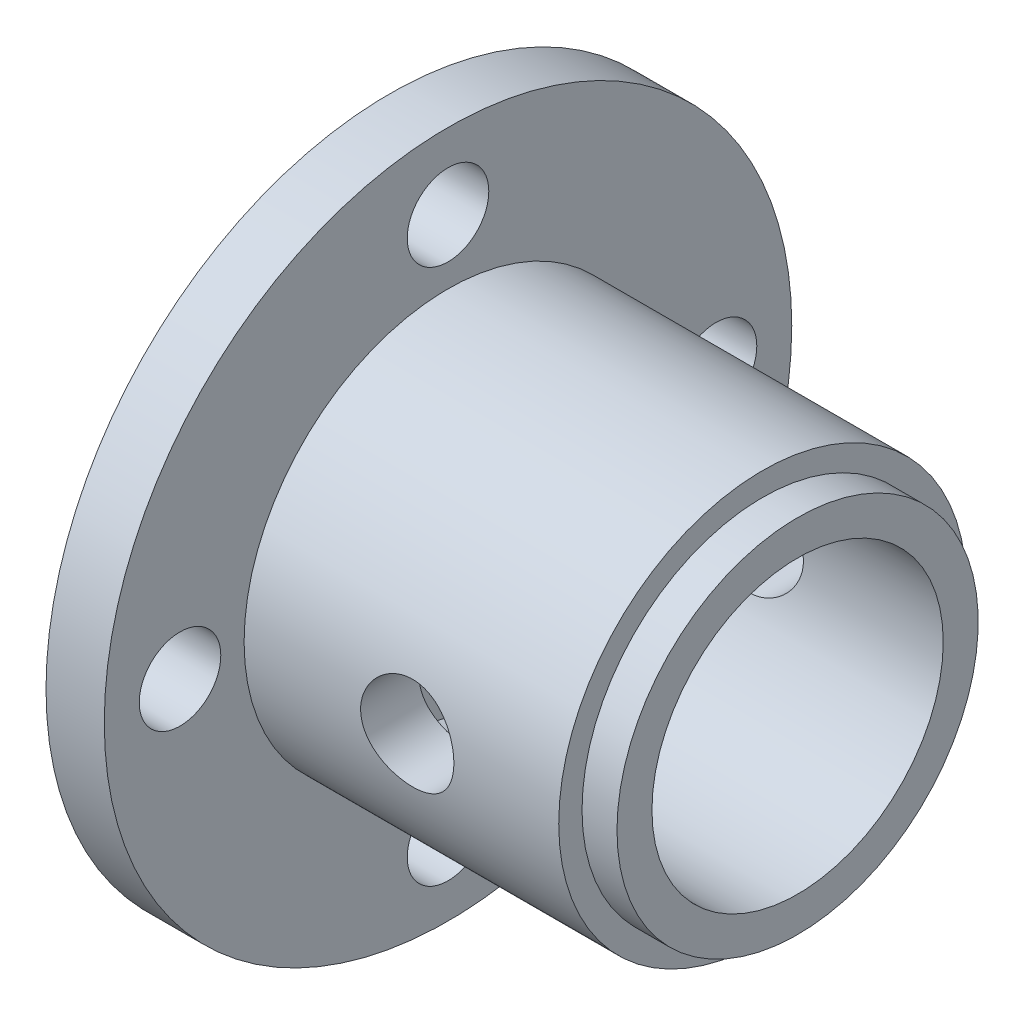
ISO-10303-21;
HEADER;
FILE_DESCRIPTION(('STEP AP214'),'2;1');
FILE_NAME('part.step','',(''),(''),'','','');
FILE_SCHEMA(('AUTOMOTIVE_DESIGN { 1 0 10303 214 1 1 1 1 }'));
ENDSEC;
DATA;
#1=APPLICATION_CONTEXT('core data for automotive mechanical design processes');
#2=APPLICATION_PROTOCOL_DEFINITION('international standard','automotive_design',2000,#1);
#3=PRODUCT_CONTEXT('',#1,'mechanical');
#4=PRODUCT('Part','Part','',(#3));
#5=PRODUCT_RELATED_PRODUCT_CATEGORY('part','',(#4));
#6=PRODUCT_DEFINITION_FORMATION('','',#4);
#7=PRODUCT_DEFINITION_CONTEXT('part definition',#1,'design');
#8=PRODUCT_DEFINITION('design','',#6,#7);
#9=PRODUCT_DEFINITION_SHAPE('','',#8);
#10=(LENGTH_UNIT() NAMED_UNIT(*) SI_UNIT(.MILLI.,.METRE.));
#11=(NAMED_UNIT(*) PLANE_ANGLE_UNIT() SI_UNIT($,.RADIAN.));
#12=(NAMED_UNIT(*) SI_UNIT($,.STERADIAN.) SOLID_ANGLE_UNIT());
#13=UNCERTAINTY_MEASURE_WITH_UNIT(LENGTH_MEASURE(1.E-05),#10,'distance_accuracy_value','');
#14=(GEOMETRIC_REPRESENTATION_CONTEXT(3) GLOBAL_UNCERTAINTY_ASSIGNED_CONTEXT((#13)) GLOBAL_UNIT_ASSIGNED_CONTEXT((#10,
#11,#12)) REPRESENTATION_CONTEXT('',''));
#15=CARTESIAN_POINT('',(0.,0.,0.));
#16=DIRECTION('',(0.,0.,1.));
#17=DIRECTION('',(1.,0.,0.));
#18=AXIS2_PLACEMENT_3D('',#15,#16,#17);
#19=CARTESIAN_POINT('',(-19.,0.,0.));
#20=DIRECTION('',(-1.,0.,0.));
#21=DIRECTION('',(0.,0.,1.));
#22=AXIS2_PLACEMENT_3D('',#19,#20,#21);
#23=PLANE('',#22);
#24=CARTESIAN_POINT('',(-19.,0.,0.));
#25=DIRECTION('',(-1.,0.,0.));
#26=DIRECTION('',(0.,0.,1.));
#27=AXIS2_PLACEMENT_3D('',#24,#25,#26);
#28=CIRCLE('',#27,7.5);
#29=CARTESIAN_POINT('',(-19.,0.,7.5));
#30=VERTEX_POINT('',#29);
#31=EDGE_CURVE('E115',#30,#30,#28,.T.);
#32=ORIENTED_EDGE('',*,*,#31,.T.);
#33=EDGE_LOOP('',(#32));
#34=FACE_BOUND('',#33,.T.);
#35=ADVANCED_FACE('F39',(#34),#23,.T.);
#36=CARTESIAN_POINT('',(-9.,0.,0.));
#37=DIRECTION('',(-1.,0.,0.));
#38=DIRECTION('',(0.,0.,1.));
#39=AXIS2_PLACEMENT_3D('',#36,#37,#38);
#40=PLANE('',#39);
#41=CARTESIAN_POINT('',(-9.,0.,0.));
#42=DIRECTION('',(-1.,0.,0.));
#43=DIRECTION('',(0.,0.,1.));
#44=AXIS2_PLACEMENT_3D('',#41,#42,#43);
#45=CIRCLE('',#44,12.5);
#46=CARTESIAN_POINT('',(-9.,0.,12.5));
#47=VERTEX_POINT('',#46);
#48=EDGE_CURVE('E10',#47,#47,#45,.T.);
#49=ORIENTED_EDGE('',*,*,#48,.F.);
#50=EDGE_LOOP('',(#49));
#51=FACE_BOUND('',#50,.T.);
#52=ADVANCED_FACE('F101',(#51),#40,.F.);
#53=CARTESIAN_POINT('',(-19.,0.,0.));
#54=DIRECTION('',(-1.,0.,0.));
#55=DIRECTION('',(0.,0.,1.));
#56=AXIS2_PLACEMENT_3D('',#53,#54,#55);
#57=CYLINDRICAL_SURFACE('',#56,12.5);
#58=CARTESIAN_POINT('',(7.,0.,12.5));
#59=CARTESIAN_POINT('',(6.99999939087354,0.218739515789949,12.4999994635907));
#60=CARTESIAN_POINT('',(6.98199851180186,0.437486592647652,12.4942046039089));
#61=CARTESIAN_POINT('',(6.91067045117684,0.868567253093707,12.4716565543057));
#62=CARTESIAN_POINT('',(6.85733682045522,1.08089965843427,12.454901363839));
#63=CARTESIAN_POINT('',(6.71733769697057,1.49287306447891,12.4122595908852));
#64=CARTESIAN_POINT('',(6.63072526907348,1.69253368346149,12.3863875511298));
#65=CARTESIAN_POINT('',(6.42685792478184,2.0744969071279,12.3281725410718));
#66=CARTESIAN_POINT('',(6.30959773558598,2.25679651756237,12.2958284575098));
#67=CARTESIAN_POINT('',(6.04378971623991,2.60473689448745,12.2269266983455));
#68=CARTESIAN_POINT('',(5.89443225261641,2.76974023061599,12.1902739433225));
#69=CARTESIAN_POINT('',(5.5703923336315,3.07283559233071,12.1174266425772));
#70=CARTESIAN_POINT('',(5.39570488086293,3.21092229484498,12.0812321888099));
#71=CARTESIAN_POINT('',(5.02036786372392,3.45978487684573,12.012370269974));
#72=CARTESIAN_POINT('',(4.81915929682322,3.56975307774839,11.9798196408788));
#73=CARTESIAN_POINT('',(4.39989414057513,3.75402292836496,11.9233664449728));
#74=CARTESIAN_POINT('',(4.18184225503076,3.82833449433394,11.8994614742253));
#75=CARTESIAN_POINT('',(3.74229348181631,3.93682835778228,11.8640030689908));
#76=CARTESIAN_POINT('',(3.52111974561444,3.97219742115687,11.8520853732299));
#77=CARTESIAN_POINT('',(3.07568100204432,4.00551082647404,11.8408707762137));
#78=CARTESIAN_POINT('',(2.85141688039044,4.00346567735333,11.8415703310132));
#79=CARTESIAN_POINT('',(2.41608603775093,3.96293451839878,11.8551904771854));
#80=CARTESIAN_POINT('',(2.20485886629904,3.92597105327877,11.8676004346024));
#81=CARTESIAN_POINT('',(1.79177788886005,3.81912647431514,11.9024114349979));
#82=CARTESIAN_POINT('',(1.58992512601733,3.74924170672462,11.9248135869381));
#83=CARTESIAN_POINT('',(1.19775535296302,3.57749112898224,11.9774663544073));
#84=CARTESIAN_POINT('',(1.00765945012865,3.47515682759627,12.0078307368189));
#85=CARTESIAN_POINT('',(0.646844892425728,3.24173735834848,12.0729361214443));
#86=CARTESIAN_POINT('',(0.47613149313914,3.11064442067799,12.1076783053403));
#87=CARTESIAN_POINT('',(0.150338317836393,2.81601378851059,12.1796593035711));
#88=CARTESIAN_POINT('',(-0.00360194234647353,2.65122340623531,12.216938020211));
#89=CARTESIAN_POINT('',(-0.281946695584691,2.29770358054263,12.2883292028654));
#90=CARTESIAN_POINT('',(-0.406348782857392,2.10897218913167,12.3224414108409));
#91=CARTESIAN_POINT('',(-0.622908608200415,1.710653951781,12.3840447436164));
#92=CARTESIAN_POINT('',(-0.714782752091045,1.50090319860161,12.411477013699));
#93=CARTESIAN_POINT('',(-0.861598991656818,1.06783962590281,12.4562040275044));
#94=CARTESIAN_POINT('',(-0.916552869541808,0.844531157828866,12.4735020051158));
#95=CARTESIAN_POINT('',(-0.986000166663035,0.4003544739733,12.4954856059785));
#96=CARTESIAN_POINT('',(-1.00203518402776,0.179750715042685,12.5006515044539));
#97=CARTESIAN_POINT('',(-0.997551954446751,-0.261025673970266,12.4992163829611));
#98=CARTESIAN_POINT('',(-0.977039336725304,-0.4811983652186,12.4926171751051));
#99=CARTESIAN_POINT('',(-0.901274717297092,-0.908837545509532,12.4687095079374));
#100=CARTESIAN_POINT('',(-0.84695022478525,-1.11648590619506,12.4516871662316));
#101=CARTESIAN_POINT('',(-0.706245501509376,-1.51965413650146,12.4089396498837));
#102=CARTESIAN_POINT('',(-0.619861258494565,-1.71517248448531,12.3832133859887));
#103=CARTESIAN_POINT('',(-0.415072457054624,-2.09399230967612,12.3248882754976));
#104=CARTESIAN_POINT('',(-0.295918720144244,-2.27686405125242,12.2921331567523));
#105=CARTESIAN_POINT('',(-0.0298653175359155,-2.62052875751655,12.223485206012));
#106=CARTESIAN_POINT('',(0.117042216145756,-2.78131543888496,12.187591485802));
#107=CARTESIAN_POINT('',(0.441685399027398,-3.08320803721588,12.1148241820809));
#108=CARTESIAN_POINT('',(0.620450669221195,-3.22321448689051,12.0779721041684));
#109=CARTESIAN_POINT('',(0.99973668614553,-3.47135354981424,12.0090110777536));
#110=CARTESIAN_POINT('',(1.20025725363512,-3.57948642564104,11.9769020901785));
#111=CARTESIAN_POINT('',(1.6171089466402,-3.76018950753079,11.9214065721644));
#112=CARTESIAN_POINT('',(1.83338533747423,-3.83287665768615,11.8979914205013));
#113=CARTESIAN_POINT('',(2.27601802452581,-3.94051670615503,11.8627820424832));
#114=CARTESIAN_POINT('',(2.50237020283996,-3.97548487516418,11.8509831134183));
#115=CARTESIAN_POINT('',(2.94718992290997,-4.00556338278915,11.8408481974692));
#116=CARTESIAN_POINT('',(3.16552252832248,-4.00248471115016,11.8419004772846));
#117=CARTESIAN_POINT('',(3.59839251358675,-3.96095887873426,11.8558539773436));
#118=CARTESIAN_POINT('',(3.81293008640258,-3.92251352152803,11.8687545933658));
#119=CARTESIAN_POINT('',(4.2287085634422,-3.81258331041153,11.9045135786104));
#120=CARTESIAN_POINT('',(4.43010799723217,-3.74164069856766,11.9272081809191));
#121=CARTESIAN_POINT('',(4.81830440100203,-3.56916068710955,11.979949389859));
#122=CARTESIAN_POINT('',(5.00509828940675,-3.46761685286564,12.009997542498));
#123=CARTESIAN_POINT('',(5.36702407453602,-3.2319816676858,12.0755873592094));
#124=CARTESIAN_POINT('',(5.54137065683511,-3.09673271078946,12.111302976317));
#125=CARTESIAN_POINT('',(5.8654793645524,-2.79953499482211,12.1834295211838));
#126=CARTESIAN_POINT('',(6.01523476299661,-2.63757895417058,12.2198406361674));
#127=CARTESIAN_POINT('',(6.29114571480958,-2.28478052574588,12.2907777050029));
#128=CARTESIAN_POINT('',(6.41629737971076,-2.09312837940195,12.3251937970096));
#129=CARTESIAN_POINT('',(6.63245047024306,-1.69040882481734,12.3868446924465));
#130=CARTESIAN_POINT('',(6.72346369830198,-1.47934815802039,12.4140819767823));
#131=CARTESIAN_POINT('',(6.86311944957609,-1.05915857911211,12.4567085266016));
#132=CARTESIAN_POINT('',(6.91429612645777,-0.850941916218324,12.4727975325363));
#133=CARTESIAN_POINT('',(6.98273285726003,-0.428485002690297,12.4944423385348));
#134=CARTESIAN_POINT('',(7.00000059661367,-0.214246128153486,12.5000005253903));
#135=CARTESIAN_POINT('',(7.,0.,12.5));
#136=B_SPLINE_CURVE_WITH_KNOTS('',3,(#58,#59,#60,#61,#62,#63,#64,#65,#66,#67,#68,#69,#70,#71,
#72,#73,#74,#75,#76,#77,#78,#79,#80,#81,#82,#83,#84,#85,#86,#87,#88,#89,#90,#91,#92,#93,#94,#95,
#96,#97,#98,#99,#100,#101,#102,#103,#104,#105,#106,#107,#108,#109,#110,#111,#112,#113,#114,#115,
#116,#117,#118,#119,#120,#121,#122,#123,#124,#125,#126,#127,#128,#129,#130,#131,#132,#133,#134,
#135),.UNSPECIFIED.,.T.,.F.,(4,2,2,2,2,2,2,2,2,2,2,2,2,2,2,2,2,2,2,2,2,2,2,2,2,2,2,2,2,2,2,2,2,
2,2,2,2,2,4),(0.,0.655430724666219,1.31098111587091,1.96549050527928,2.62011257411758,
3.29374295378918,3.96750641671065,4.65887072066567,5.35004264179887,6.01951224998767,
6.68879381985559,7.33017723381302,7.97163184802041,8.62280489842004,9.27415409537618,
9.95668212026653,10.6392657156648,11.3276617834058,12.0158380617097,12.6762752648346,
13.3366107533684,13.9795854097457,14.6226405610093,15.281833876428,15.9412143491714,
16.6280748263774,17.3149296449995,17.9995027669286,18.6837986322709,19.3356533743721,
19.9874748761256,20.6287955720838,21.2702512150686,21.937843916949,22.6056189371905,
23.2966571383324,23.9874562112942,24.6295685076846,25.2715352530413),.UNSPECIFIED.);
#137=CARTESIAN_POINT('',(7.,0.,12.5));
#138=VERTEX_POINT('',#137);
#139=EDGE_CURVE('E91',#138,#138,#136,.T.);
#140=ORIENTED_EDGE('',*,*,#139,.T.);
#141=EDGE_LOOP('',(#140));
#142=FACE_BOUND('',#141,.T.);
#143=CARTESIAN_POINT('',(6.99999999999999,0.,-12.5));
#144=CARTESIAN_POINT('',(6.99999939087354,-0.218739515789949,-12.4999994635907));
#145=CARTESIAN_POINT('',(6.98199851180186,-0.437486592647651,-12.4942046039089));
#146=CARTESIAN_POINT('',(6.91067045117684,-0.868567253093706,-12.4716565543057));
#147=CARTESIAN_POINT('',(6.85733682045522,-1.08089965843427,-12.454901363839));
#148=CARTESIAN_POINT('',(6.71733769697057,-1.49287306447891,-12.4122595908852));
#149=CARTESIAN_POINT('',(6.63072526907348,-1.69253368346149,-12.3863875511298));
#150=CARTESIAN_POINT('',(6.42685792478184,-2.07449690712789,-12.3281725410718));
#151=CARTESIAN_POINT('',(6.30959773558598,-2.25679651756237,-12.2958284575098));
#152=CARTESIAN_POINT('',(6.04378971623991,-2.60473689448744,-12.2269266983455));
#153=CARTESIAN_POINT('',(5.89443225261642,-2.76974023061599,-12.1902739433225));
#154=CARTESIAN_POINT('',(5.57039233363151,-3.07283559233071,-12.1174266425772));
#155=CARTESIAN_POINT('',(5.39570488086293,-3.21092229484498,-12.0812321888099));
#156=CARTESIAN_POINT('',(5.02036786372393,-3.45978487684573,-12.012370269974));
#157=CARTESIAN_POINT('',(4.81915929682323,-3.56975307774839,-11.9798196408788));
#158=CARTESIAN_POINT('',(4.39989414057514,-3.75402292836496,-11.9233664449728));
#159=CARTESIAN_POINT('',(4.18184225503077,-3.82833449433394,-11.8994614742253));
#160=CARTESIAN_POINT('',(3.74229348181632,-3.93682835778228,-11.8640030689908));
#161=CARTESIAN_POINT('',(3.52111974561444,-3.97219742115686,-11.8520853732299));
#162=CARTESIAN_POINT('',(3.07568100204432,-4.00551082647404,-11.8408707762137));
#163=CARTESIAN_POINT('',(2.85141688039045,-4.00346567735333,-11.8415703310132));
#164=CARTESIAN_POINT('',(2.41608603775093,-3.96293451839878,-11.8551904771854));
#165=CARTESIAN_POINT('',(2.20485886629904,-3.92597105327877,-11.8676004346024));
#166=CARTESIAN_POINT('',(1.79177788886005,-3.81912647431514,-11.9024114349979));
#167=CARTESIAN_POINT('',(1.58992512601733,-3.74924170672462,-11.9248135869381));
#168=CARTESIAN_POINT('',(1.19775535296302,-3.57749112898224,-11.9774663544073));
#169=CARTESIAN_POINT('',(1.00765945012865,-3.47515682759627,-12.0078307368189));
#170=CARTESIAN_POINT('',(0.646844892425728,-3.24173735834848,-12.0729361214443));
#171=CARTESIAN_POINT('',(0.476131493139139,-3.11064442067799,-12.1076783053403));
#172=CARTESIAN_POINT('',(0.150338317836393,-2.81601378851059,-12.1796593035711));
#173=CARTESIAN_POINT('',(-0.00360194234647385,-2.65122340623531,-12.216938020211));
#174=CARTESIAN_POINT('',(-0.281946695584691,-2.29770358054263,-12.2883292028654));
#175=CARTESIAN_POINT('',(-0.406348782857392,-2.10897218913167,-12.3224414108409));
#176=CARTESIAN_POINT('',(-0.622908608200415,-1.710653951781,-12.3840447436164));
#177=CARTESIAN_POINT('',(-0.714782752091045,-1.50090319860161,-12.411477013699));
#178=CARTESIAN_POINT('',(-0.861598991656818,-1.06783962590281,-12.4562040275044));
#179=CARTESIAN_POINT('',(-0.916552869541808,-0.844531157828867,-12.4735020051158));
#180=CARTESIAN_POINT('',(-0.986000166663036,-0.400354473973302,-12.4954856059785));
#181=CARTESIAN_POINT('',(-1.00203518402776,-0.179750715042687,-12.5006515044539));
#182=CARTESIAN_POINT('',(-0.997551954446751,0.261025673970264,-12.4992163829611));
#183=CARTESIAN_POINT('',(-0.977039336725306,0.481198365218598,-12.4926171751051));
#184=CARTESIAN_POINT('',(-0.901274717297093,0.908837545509528,-12.4687095079374));
#185=CARTESIAN_POINT('',(-0.846950224785252,1.11648590619505,-12.4516871662316));
#186=CARTESIAN_POINT('',(-0.706245501509378,1.51965413650145,-12.4089396498837));
#187=CARTESIAN_POINT('',(-0.619861258494568,1.71517248448531,-12.3832133859887));
#188=CARTESIAN_POINT('',(-0.415072457054627,2.09399230967611,-12.3248882754976));
#189=CARTESIAN_POINT('',(-0.295918720144248,2.27686405125241,-12.2921331567523));
#190=CARTESIAN_POINT('',(-0.0298653175359197,2.62052875751655,-12.223485206012));
#191=CARTESIAN_POINT('',(0.117042216145752,2.78131543888496,-12.187591485802));
#192=CARTESIAN_POINT('',(0.441685399027393,3.08320803721588,-12.1148241820809));
#193=CARTESIAN_POINT('',(0.620450669221191,3.22321448689051,-12.0779721041684));
#194=CARTESIAN_POINT('',(0.999736686145526,3.47135354981423,-12.0090110777536));
#195=CARTESIAN_POINT('',(1.20025725363511,3.57948642564104,-11.9769020901785));
#196=CARTESIAN_POINT('',(1.6171089466402,3.76018950753079,-11.9214065721644));
#197=CARTESIAN_POINT('',(1.83338533747422,3.83287665768615,-11.8979914205013));
#198=CARTESIAN_POINT('',(2.27601802452581,3.94051670615503,-11.8627820424832));
#199=CARTESIAN_POINT('',(2.50237020283996,3.97548487516418,-11.8509831134183));
#200=CARTESIAN_POINT('',(2.94718992290997,4.00556338278915,-11.8408481974692));
#201=CARTESIAN_POINT('',(3.16552252832247,4.00248471115016,-11.8419004772846));
#202=CARTESIAN_POINT('',(3.59839251358675,3.96095887873426,-11.8558539773436));
#203=CARTESIAN_POINT('',(3.81293008640257,3.92251352152803,-11.8687545933658));
#204=CARTESIAN_POINT('',(4.2287085634422,3.81258331041153,-11.9045135786104));
#205=CARTESIAN_POINT('',(4.43010799723217,3.74164069856766,-11.9272081809191));
#206=CARTESIAN_POINT('',(4.81830440100203,3.56916068710955,-11.979949389859));
#207=CARTESIAN_POINT('',(5.00509828940675,3.46761685286564,-12.009997542498));
#208=CARTESIAN_POINT('',(5.36702407453602,3.2319816676858,-12.0755873592094));
#209=CARTESIAN_POINT('',(5.54137065683511,3.09673271078946,-12.111302976317));
#210=CARTESIAN_POINT('',(5.8654793645524,2.79953499482211,-12.1834295211838));
#211=CARTESIAN_POINT('',(6.01523476299661,2.63757895417058,-12.2198406361674));
#212=CARTESIAN_POINT('',(6.29114571480958,2.28478052574588,-12.2907777050029));
#213=CARTESIAN_POINT('',(6.41629737971076,2.09312837940195,-12.3251937970096));
#214=CARTESIAN_POINT('',(6.63245047024306,1.69040882481734,-12.3868446924465));
#215=CARTESIAN_POINT('',(6.72346369830198,1.47934815802039,-12.4140819767823));
#216=CARTESIAN_POINT('',(6.86311944957609,1.05915857911211,-12.4567085266016));
#217=CARTESIAN_POINT('',(6.91429612645777,0.850941916218328,-12.4727975325363));
#218=CARTESIAN_POINT('',(6.98273285726003,0.428485002690301,-12.4944423385348));
#219=CARTESIAN_POINT('',(7.00000059661367,0.214246128153488,-12.5000005253903));
#220=CARTESIAN_POINT('',(6.99999999999999,0.,-12.5));
#221=B_SPLINE_CURVE_WITH_KNOTS('',3,(#143,#144,#145,#146,#147,#148,#149,#150,#151,#152,#153,
#154,#155,#156,#157,#158,#159,#160,#161,#162,#163,#164,#165,#166,#167,#168,#169,#170,#171,#172,
#173,#174,#175,#176,#177,#178,#179,#180,#181,#182,#183,#184,#185,#186,#187,#188,#189,#190,#191,
#192,#193,#194,#195,#196,#197,#198,#199,#200,#201,#202,#203,#204,#205,#206,#207,#208,#209,#210,
#211,#212,#213,#214,#215,#216,#217,#218,#219,#220),.UNSPECIFIED.,.T.,.F.,(4,2,2,2,2,2,2,2,2,2,2,
2,2,2,2,2,2,2,2,2,2,2,2,2,2,2,2,2,2,2,2,2,2,2,2,2,2,2,4),(0.,0.655430724666218,1.31098111587091,
1.96549050527928,2.62011257411757,3.29374295378917,3.96750641671065,4.65887072066566,
5.35004264179887,6.01951224998766,6.68879381985559,7.33017723381302,7.97163184802041,
8.62280489842004,9.27415409537618,9.95668212026653,10.6392657156648,11.3276617834058,
12.0158380617097,12.6762752648346,13.3366107533684,13.9795854097457,14.6226405610093,
15.281833876428,15.9412143491714,16.6280748263774,17.3149296449995,17.9995027669286,
18.6837986322709,19.3356533743721,19.9874748761257,20.6287955720839,21.2702512150686,
21.937843916949,22.6056189371905,23.2966571383324,23.9874562112942,24.6295685076846,
25.2715352530413),.UNSPECIFIED.);
#222=CARTESIAN_POINT('',(6.99999999999999,0.,-12.5));
#223=VERTEX_POINT('',#222);
#224=EDGE_CURVE('E84',#223,#223,#221,.T.);
#225=ORIENTED_EDGE('',*,*,#224,.T.);
#226=EDGE_LOOP('',(#225));
#227=FACE_BOUND('',#226,.T.);
#228=CARTESIAN_POINT('',(19.,0.,0.));
#229=DIRECTION('',(-1.,0.,0.));
#230=DIRECTION('',(0.,0.,1.));
#231=AXIS2_PLACEMENT_3D('',#228,#229,#230);
#232=CIRCLE('',#231,12.5);
#233=CARTESIAN_POINT('',(19.,0.,12.5));
#234=VERTEX_POINT('',#233);
#235=EDGE_CURVE('E52',#234,#234,#232,.T.);
#236=ORIENTED_EDGE('',*,*,#235,.F.);
#237=EDGE_LOOP('',(#236));
#238=FACE_BOUND('',#237,.T.);
#239=ORIENTED_EDGE('',*,*,#48,.T.);
#240=EDGE_LOOP('',(#239));
#241=FACE_BOUND('',#240,.T.);
#242=ADVANCED_FACE('F96',(#142,#227,#238,#241),#57,.F.);
#243=CARTESIAN_POINT('',(19.,0.,0.));
#244=DIRECTION('',(1.,0.,0.));
#245=DIRECTION('',(0.,0.,-1.));
#246=AXIS2_PLACEMENT_3D('',#243,#244,#245);
#247=PLANE('',#246);
#248=ORIENTED_EDGE('',*,*,#235,.T.);
#249=EDGE_LOOP('',(#248));
#250=FACE_BOUND('',#249,.T.);
#251=CARTESIAN_POINT('',(19.,0.,0.));
#252=DIRECTION('',(-1.,0.,0.));
#253=DIRECTION('',(0.,0.,1.));
#254=AXIS2_PLACEMENT_3D('',#251,#252,#253);
#255=CIRCLE('',#254,15.5);
#256=CARTESIAN_POINT('',(19.,0.,15.5));
#257=VERTEX_POINT('',#256);
#258=EDGE_CURVE('E58',#257,#257,#255,.T.);
#259=ORIENTED_EDGE('',*,*,#258,.F.);
#260=EDGE_LOOP('',(#259));
#261=FACE_BOUND('',#260,.T.);
#262=ADVANCED_FACE('F100',(#250,#261),#247,.T.);
#263=CARTESIAN_POINT('',(-19.,0.,0.));
#264=DIRECTION('',(-1.,0.,0.));
#265=DIRECTION('',(0.,0.,1.));
#266=AXIS2_PLACEMENT_3D('',#263,#264,#265);
#267=CYLINDRICAL_SURFACE('',#266,15.5);
#268=ORIENTED_EDGE('',*,*,#258,.T.);
#269=EDGE_LOOP('',(#268));
#270=FACE_BOUND('',#269,.T.);
#271=CARTESIAN_POINT('',(16.,0.,0.));
#272=DIRECTION('',(-1.,0.,0.));
#273=DIRECTION('',(0.,0.,1.));
#274=AXIS2_PLACEMENT_3D('',#271,#272,#273);
#275=CIRCLE('',#274,15.5);
#276=CARTESIAN_POINT('',(16.,0.,15.5));
#277=VERTEX_POINT('',#276);
#278=EDGE_CURVE('E147',#277,#277,#275,.T.);
#279=ORIENTED_EDGE('',*,*,#278,.F.);
#280=EDGE_LOOP('',(#279));
#281=FACE_BOUND('',#280,.T.);
#282=ADVANCED_FACE('F154',(#270,#281),#267,.T.);
#283=CARTESIAN_POINT('',(16.,0.,0.));
#284=DIRECTION('',(1.,0.,0.));
#285=DIRECTION('',(0.,0.,-1.));
#286=AXIS2_PLACEMENT_3D('',#283,#284,#285);
#287=PLANE('',#286);
#288=ORIENTED_EDGE('',*,*,#278,.T.);
#289=EDGE_LOOP('',(#288));
#290=FACE_BOUND('',#289,.T.);
#291=CARTESIAN_POINT('',(16.,0.,0.));
#292=DIRECTION('',(-1.,0.,0.));
#293=DIRECTION('',(0.,0.,1.));
#294=AXIS2_PLACEMENT_3D('',#291,#292,#293);
#295=CIRCLE('',#294,17.5);
#296=CARTESIAN_POINT('',(16.,0.,17.5));
#297=VERTEX_POINT('',#296);
#298=EDGE_CURVE('E143',#297,#297,#295,.T.);
#299=ORIENTED_EDGE('',*,*,#298,.F.);
#300=EDGE_LOOP('',(#299));
#301=FACE_BOUND('',#300,.T.);
#302=ADVANCED_FACE('F162',(#290,#301),#287,.T.);
#303=CARTESIAN_POINT('',(-19.,0.,0.));
#304=DIRECTION('',(-1.,0.,0.));
#305=DIRECTION('',(0.,0.,1.));
#306=AXIS2_PLACEMENT_3D('',#303,#304,#305);
#307=CYLINDRICAL_SURFACE('',#306,17.5);
#308=CARTESIAN_POINT('',(7.,0.,17.5));
#309=CARTESIAN_POINT('',(6.99999280159254,0.221594935282783,17.499995968068));
#310=CARTESIAN_POINT('',(6.98152376528403,0.443274756959128,17.4957485358512));
#311=CARTESIAN_POINT('',(6.9082224672252,0.880320521290673,17.4792153051271));
#312=CARTESIAN_POINT('',(6.85336584434501,1.09568213303245,17.4669241214815));
#313=CARTESIAN_POINT('',(6.70911086250509,1.51371360660757,17.4356696772318));
#314=CARTESIAN_POINT('',(6.61975023329363,1.7163970515423,17.4167137065161));
#315=CARTESIAN_POINT('',(6.40914763128195,2.10389021634727,17.3741673572337));
#316=CARTESIAN_POINT('',(6.28790589805239,2.28870007051439,17.3505770134924));
#317=CARTESIAN_POINT('',(6.0147477901595,2.63842568761195,17.3008795298367));
#318=CARTESIAN_POINT('',(5.86238163135079,2.8029853970679,17.2747388181941));
#319=CARTESIAN_POINT('',(5.53226461063246,3.1044499115144,17.223119203773));
#320=CARTESIAN_POINT('',(5.35451131769424,3.24135206502983,17.1976403646508));
#321=CARTESIAN_POINT('',(4.97599343786498,3.48521732049751,17.1498961972962));
#322=CARTESIAN_POINT('',(4.77497501674313,3.59179558541503,17.1276737744502));
#323=CARTESIAN_POINT('',(4.35728812839201,3.76951731339889,17.0894428847913));
#324=CARTESIAN_POINT('',(4.14062172312377,3.84066543543489,17.0734336010283));
#325=CARTESIAN_POINT('',(3.70166809815478,3.94431902613062,17.0497845472768));
#326=CARTESIAN_POINT('',(3.47953800096165,3.97745793088181,17.0420077545908));
#327=CARTESIAN_POINT('',(3.03274542109966,4.00612307635684,17.035293111181));
#328=CARTESIAN_POINT('',(2.80808328361118,4.00165438345226,17.0363540698644));
#329=CARTESIAN_POINT('',(2.36735608113469,3.95573961410788,17.0470712601244));
#330=CARTESIAN_POINT('',(2.15120894069917,3.91503498212017,17.0565551364498));
#331=CARTESIAN_POINT('',(1.72889506341676,3.7989808959904,17.0827764200256));
#332=CARTESIAN_POINT('',(1.52272893330609,3.72362933860985,17.0995142676242));
#333=CARTESIAN_POINT('',(1.12417413531916,3.53975448878011,17.138523865828));
#334=CARTESIAN_POINT('',(0.931919489565435,3.43095096279258,17.1608420572298));
#335=CARTESIAN_POINT('',(0.568124744852049,3.18345740925708,17.2084698633587));
#336=CARTESIAN_POINT('',(0.396587719924317,3.04476295504351,17.2337799209123));
#337=CARTESIAN_POINT('',(0.0748345121552149,2.73752505065933,17.2852750505473));
#338=CARTESIAN_POINT('',(-0.0747805611737019,2.56835251342571,17.3114666500678));
#339=CARTESIAN_POINT('',(-0.343619605346153,2.20701546217961,17.3612295344905));
#340=CARTESIAN_POINT('',(-0.462842922823064,2.01485045400194,17.3848007630533));
#341=CARTESIAN_POINT('',(-0.667684064045218,1.61221242808024,17.4267550028416));
#342=CARTESIAN_POINT('',(-0.753217459967371,1.4016950092806,17.4451249475635));
#343=CARTESIAN_POINT('',(-0.887524668949198,0.968760585223055,17.4745105073269));
#344=CARTESIAN_POINT('',(-0.936304331581842,0.746345479589442,17.485527292635));
#345=CARTESIAN_POINT('',(-0.994831978906927,0.301080239392929,17.4987966671339));
#346=CARTESIAN_POINT('',(-1.00540029107423,0.0783432719554255,17.5012334233894));
#347=CARTESIAN_POINT('',(-0.989436670677285,-0.365714036026687,17.4975868145157));
#348=CARTESIAN_POINT('',(-0.962907499302305,-0.58703448077231,17.4915040834974));
#349=CARTESIAN_POINT('',(-0.874181179831989,-1.01921828270225,17.4716187460405));
#350=CARTESIAN_POINT('',(-0.812419509637417,-1.23017576869971,17.4579104431039));
#351=CARTESIAN_POINT('',(-0.655468959233681,-1.63873374864027,17.4243107905876));
#352=CARTESIAN_POINT('',(-0.560277057468315,-1.83633303329064,17.4044188821279));
#353=CARTESIAN_POINT('',(-0.337495264924025,-2.21591921812758,17.3602077001317));
#354=CARTESIAN_POINT('',(-0.209430202111567,-2.39761969440069,17.3358251156802));
#355=CARTESIAN_POINT('',(0.0748425729673338,-2.73724492155052,17.2854568565593));
#356=CARTESIAN_POINT('',(0.231054300870591,-2.89516627399104,17.2594709534956));
#357=CARTESIAN_POINT('',(0.570965263356096,-3.18603583539193,17.2081804262773));
#358=CARTESIAN_POINT('',(0.755157076640498,-3.31841356091018,17.1829002549519));
#359=CARTESIAN_POINT('',(1.14363677874947,-3.55036421684567,17.1364804485464));
#360=CARTESIAN_POINT('',(1.34792377657597,-3.64993860087588,17.115340630012));
#361=CARTESIAN_POINT('',(1.76968249521023,-3.81275583687656,17.0798080231766));
#362=CARTESIAN_POINT('',(1.98706965335341,-3.87620881551104,17.0653763043275));
#363=CARTESIAN_POINT('',(2.42979705402055,-3.96558236920152,17.0448320064026));
#364=CARTESIAN_POINT('',(2.65513588112797,-3.99150958975625,17.038717954349));
#365=CARTESIAN_POINT('',(3.1016030229345,-4.0047928491744,17.0356000555771));
#366=CARTESIAN_POINT('',(3.32270334466266,-3.99305540805986,17.0383820905001));
#367=CARTESIAN_POINT('',(3.75968490092247,-3.9333836212789,17.0522553971543));
#368=CARTESIAN_POINT('',(3.97556620903654,-3.88544978624981,17.0633465516653));
#369=CARTESIAN_POINT('',(4.39518153984074,-3.75520174667951,17.0924793729435));
#370=CARTESIAN_POINT('',(4.5989622425815,-3.67303100198937,17.1104920130225));
#371=CARTESIAN_POINT('',(4.98997579671055,-3.47676086584632,17.1514471657162));
#372=CARTESIAN_POINT('',(5.17720674134724,-3.3626578016596,17.1743902453407));
#373=CARTESIAN_POINT('',(5.53424866621762,-3.10280513424774,17.2232520455791));
#374=CARTESIAN_POINT('',(5.70358575952703,-2.95641450406338,17.2492251279843));
#375=CARTESIAN_POINT('',(6.01558739902593,-2.63742660785007,17.3008680931784));
#376=CARTESIAN_POINT('',(6.15824573310752,-2.46482325514099,17.3265379040506));
#377=CARTESIAN_POINT('',(6.41482687842093,-2.09530030913021,17.3751231383439));
#378=CARTESIAN_POINT('',(6.5283044969732,-1.89806528208061,17.3979933821164));
#379=CARTESIAN_POINT('',(6.72031454241371,-1.48683089541921,17.4379432084139));
#380=CARTESIAN_POINT('',(6.79887501694499,-1.27284515414195,17.4550274359953));
#381=CARTESIAN_POINT('',(6.90551388886033,-0.882343223138204,17.47858702453));
#382=CARTESIAN_POINT('',(6.94087596683342,-0.707870008416511,17.4865655617845));
#383=CARTESIAN_POINT('',(6.98812129474854,-0.355615969967493,17.4972735296406));
#384=CARTESIAN_POINT('',(7.00000577689691,-0.177835320323118,17.5000032357234));
#385=CARTESIAN_POINT('',(7.,0.,17.5));
#386=B_SPLINE_CURVE_WITH_KNOTS('',3,(#308,#309,#310,#311,#312,#313,#314,#315,#316,#317,#318,
#319,#320,#321,#322,#323,#324,#325,#326,#327,#328,#329,#330,#331,#332,#333,#334,#335,#336,#337,
#338,#339,#340,#341,#342,#343,#344,#345,#346,#347,#348,#349,#350,#351,#352,#353,#354,#355,#356,
#357,#358,#359,#360,#361,#362,#363,#364,#365,#366,#367,#368,#369,#370,#371,#372,#373,#374,#375,
#376,#377,#378,#379,#380,#381,#382,#383,#384,#385),.UNSPECIFIED.,.T.,.F.,(4,2,2,2,2,2,2,2,2,2,2,
2,2,2,2,2,2,2,2,2,2,2,2,2,2,2,2,2,2,2,2,2,2,2,2,2,2,2,4),(0.,0.664133636950417,1.32871235418463,
1.99256641063926,2.65641547870271,3.3306394824578,4.00492809209305,4.6874268949088,
5.36983592723062,6.04069914231538,6.71147198236625,7.3688273923675,8.02622271233903,
8.68928255518439,9.35244066073913,10.0313033386907,10.7101806097055,11.3907485024342,
12.071208055884,12.7369696485043,13.4026816907039,14.0603384109987,14.7180545882069,
15.3858732303227,16.0537872245365,16.7352268957805,17.4166363663565,18.0940403124228,
18.7713242812165,19.4324306212132,20.0935276348865,20.7518819365842,21.4103119908293,
22.0832282229975,22.7563009481092,23.4391031988252,24.1213559842544,24.6543673418573,
25.1873507239626),.UNSPECIFIED.);
#387=CARTESIAN_POINT('',(7.,0.,17.5));
#388=VERTEX_POINT('',#387);
#389=EDGE_CURVE('E42',#388,#388,#386,.T.);
#390=ORIENTED_EDGE('',*,*,#389,.F.);
#391=EDGE_LOOP('',(#390));
#392=FACE_BOUND('',#391,.T.);
#393=CARTESIAN_POINT('',(6.99999999999999,0.,-17.5));
#394=CARTESIAN_POINT('',(6.99999280159253,-0.221594935282783,-17.499995968068));
#395=CARTESIAN_POINT('',(6.98152376528403,-0.443274756959128,-17.4957485358512));
#396=CARTESIAN_POINT('',(6.90822246722521,-0.880320521290673,-17.4792153051271));
#397=CARTESIAN_POINT('',(6.85336584434501,-1.09568213303245,-17.4669241214815));
#398=CARTESIAN_POINT('',(6.70911086250509,-1.51371360660757,-17.4356696772318));
#399=CARTESIAN_POINT('',(6.61975023329363,-1.7163970515423,-17.4167137065161));
#400=CARTESIAN_POINT('',(6.40914763128195,-2.10389021634727,-17.3741673572337));
#401=CARTESIAN_POINT('',(6.28790589805239,-2.28870007051439,-17.3505770134924));
#402=CARTESIAN_POINT('',(6.01474779015951,-2.63842568761195,-17.3008795298367));
#403=CARTESIAN_POINT('',(5.86238163135079,-2.8029853970679,-17.2747388181941));
#404=CARTESIAN_POINT('',(5.53226461063246,-3.1044499115144,-17.223119203773));
#405=CARTESIAN_POINT('',(5.35451131769424,-3.24135206502983,-17.1976403646508));
#406=CARTESIAN_POINT('',(4.97599343786499,-3.48521732049751,-17.1498961972962));
#407=CARTESIAN_POINT('',(4.77497501674314,-3.59179558541503,-17.1276737744502));
#408=CARTESIAN_POINT('',(4.35728812839202,-3.76951731339889,-17.0894428847913));
#409=CARTESIAN_POINT('',(4.14062172312377,-3.84066543543489,-17.0734336010283));
#410=CARTESIAN_POINT('',(3.70166809815478,-3.94431902613062,-17.0497845472768));
#411=CARTESIAN_POINT('',(3.47953800096165,-3.9774579308818,-17.0420077545908));
#412=CARTESIAN_POINT('',(3.03274542109966,-4.00612307635684,-17.035293111181));
#413=CARTESIAN_POINT('',(2.80808328361118,-4.00165438345226,-17.0363540698644));
#414=CARTESIAN_POINT('',(2.36735608113469,-3.95573961410788,-17.0470712601244));
#415=CARTESIAN_POINT('',(2.15120894069918,-3.91503498212018,-17.0565551364498));
#416=CARTESIAN_POINT('',(1.72889506341676,-3.7989808959904,-17.0827764200256));
#417=CARTESIAN_POINT('',(1.5227289333061,-3.72362933860985,-17.0995142676242));
#418=CARTESIAN_POINT('',(1.12417413531916,-3.53975448878011,-17.138523865828));
#419=CARTESIAN_POINT('',(0.931919489565435,-3.43095096279258,-17.1608420572298));
#420=CARTESIAN_POINT('',(0.568124744852048,-3.18345740925708,-17.2084698633587));
#421=CARTESIAN_POINT('',(0.396587719924316,-3.04476295504351,-17.2337799209123));
#422=CARTESIAN_POINT('',(0.0748345121552154,-2.73752505065933,-17.2852750505473));
#423=CARTESIAN_POINT('',(-0.074780561173701,-2.56835251342571,-17.3114666500678));
#424=CARTESIAN_POINT('',(-0.343619605346152,-2.20701546217961,-17.3612295344905));
#425=CARTESIAN_POINT('',(-0.462842922823063,-2.01485045400194,-17.3848007630533));
#426=CARTESIAN_POINT('',(-0.667684064045217,-1.61221242808024,-17.4267550028416));
#427=CARTESIAN_POINT('',(-0.753217459967371,-1.4016950092806,-17.4451249475635));
#428=CARTESIAN_POINT('',(-0.887524668949198,-0.968760585223058,-17.4745105073269));
#429=CARTESIAN_POINT('',(-0.936304331581841,-0.746345479589444,-17.485527292635));
#430=CARTESIAN_POINT('',(-0.994831978906926,-0.30108023939293,-17.4987966671339));
#431=CARTESIAN_POINT('',(-1.00540029107423,-0.0783432719554277,-17.5012334233894));
#432=CARTESIAN_POINT('',(-0.989436670677285,0.365714036026684,-17.4975868145157));
#433=CARTESIAN_POINT('',(-0.962907499302305,0.587034480772307,-17.4915040834974));
#434=CARTESIAN_POINT('',(-0.874181179831989,1.01921828270224,-17.4716187460405));
#435=CARTESIAN_POINT('',(-0.812419509637417,1.23017576869971,-17.4579104431039));
#436=CARTESIAN_POINT('',(-0.655468959233682,1.63873374864027,-17.4243107905876));
#437=CARTESIAN_POINT('',(-0.560277057468317,1.83633303329064,-17.4044188821279));
#438=CARTESIAN_POINT('',(-0.337495264924028,2.21591921812757,-17.3602077001317));
#439=CARTESIAN_POINT('',(-0.20943020211157,2.39761969440068,-17.3358251156802));
#440=CARTESIAN_POINT('',(0.0748425729673297,2.73724492155052,-17.2854568565593));
#441=CARTESIAN_POINT('',(0.231054300870586,2.89516627399103,-17.2594709534956));
#442=CARTESIAN_POINT('',(0.570965263356091,3.18603583539193,-17.2081804262773));
#443=CARTESIAN_POINT('',(0.755157076640494,3.31841356091017,-17.1829002549519));
#444=CARTESIAN_POINT('',(1.14363677874947,3.55036421684567,-17.1364804485464));
#445=CARTESIAN_POINT('',(1.34792377657596,3.64993860087588,-17.115340630012));
#446=CARTESIAN_POINT('',(1.76968249521023,3.81275583687656,-17.0798080231766));
#447=CARTESIAN_POINT('',(1.9870696533534,3.87620881551104,-17.0653763043275));
#448=CARTESIAN_POINT('',(2.42979705402055,3.96558236920152,-17.0448320064026));
#449=CARTESIAN_POINT('',(2.65513588112796,3.99150958975625,-17.038717954349));
#450=CARTESIAN_POINT('',(3.10160302293449,4.0047928491744,-17.0356000555771));
#451=CARTESIAN_POINT('',(3.32270334466266,3.99305540805986,-17.0383820905001));
#452=CARTESIAN_POINT('',(3.75968490092247,3.9333836212789,-17.0522553971543));
#453=CARTESIAN_POINT('',(3.97556620903653,3.88544978624981,-17.0633465516653));
#454=CARTESIAN_POINT('',(4.39518153984073,3.75520174667951,-17.0924793729435));
#455=CARTESIAN_POINT('',(4.59896224258149,3.67303100198937,-17.1104920130225));
#456=CARTESIAN_POINT('',(4.98997579671055,3.47676086584632,-17.1514471657162));
#457=CARTESIAN_POINT('',(5.17720674134724,3.3626578016596,-17.1743902453407));
#458=CARTESIAN_POINT('',(5.53424866621762,3.10280513424774,-17.2232520455791));
#459=CARTESIAN_POINT('',(5.70358575952702,2.95641450406339,-17.2492251279843));
#460=CARTESIAN_POINT('',(6.01558739902593,2.63742660785008,-17.3008680931784));
#461=CARTESIAN_POINT('',(6.15824573310752,2.46482325514099,-17.3265379040506));
#462=CARTESIAN_POINT('',(6.41482687842093,2.09530030913021,-17.3751231383439));
#463=CARTESIAN_POINT('',(6.52830449697319,1.89806528208061,-17.3979933821164));
#464=CARTESIAN_POINT('',(6.72031454241371,1.48683089541922,-17.4379432084139));
#465=CARTESIAN_POINT('',(6.79887501694498,1.27284515414195,-17.4550274359953));
#466=CARTESIAN_POINT('',(6.90551388886033,0.882343223138207,-17.47858702453));
#467=CARTESIAN_POINT('',(6.94087596683343,0.707870008416513,-17.4865655617845));
#468=CARTESIAN_POINT('',(6.98812129474854,0.355615969967494,-17.4972735296406));
#469=CARTESIAN_POINT('',(7.0000057768969,0.177835320323118,-17.5000032357234));
#470=CARTESIAN_POINT('',(6.99999999999999,0.,-17.5));
#471=B_SPLINE_CURVE_WITH_KNOTS('',3,(#393,#394,#395,#396,#397,#398,#399,#400,#401,#402,#403,
#404,#405,#406,#407,#408,#409,#410,#411,#412,#413,#414,#415,#416,#417,#418,#419,#420,#421,#422,
#423,#424,#425,#426,#427,#428,#429,#430,#431,#432,#433,#434,#435,#436,#437,#438,#439,#440,#441,
#442,#443,#444,#445,#446,#447,#448,#449,#450,#451,#452,#453,#454,#455,#456,#457,#458,#459,#460,
#461,#462,#463,#464,#465,#466,#467,#468,#469,#470),.UNSPECIFIED.,.T.,.F.,(4,2,2,2,2,2,2,2,2,2,2,
2,2,2,2,2,2,2,2,2,2,2,2,2,2,2,2,2,2,2,2,2,2,2,2,2,2,2,4),(0.,0.664133636950417,1.32871235418463,
1.99256641063926,2.6564154787027,3.3306394824578,4.00492809209305,4.6874268949088,
5.36983592723062,6.04069914231537,6.71147198236624,7.36882739236749,8.02622271233902,
8.68928255518439,9.35244066073913,10.0313033386907,10.7101806097055,11.3907485024342,
12.071208055884,12.7369696485043,13.4026816907039,14.0603384109987,14.7180545882069,
15.3858732303227,16.0537872245365,16.7352268957805,17.4166363663565,18.0940403124228,
18.7713242812165,19.4324306212132,20.0935276348865,20.7518819365842,21.4103119908293,
22.0832282229975,22.7563009481092,23.4391031988252,24.1213559842544,24.6543673418573,
25.1873507239626),.UNSPECIFIED.);
#472=CARTESIAN_POINT('',(6.99999999999999,0.,-17.5));
#473=VERTEX_POINT('',#472);
#474=EDGE_CURVE('E61',#473,#473,#471,.T.);
#475=ORIENTED_EDGE('',*,*,#474,.F.);
#476=EDGE_LOOP('',(#475));
#477=FACE_BOUND('',#476,.T.);
#478=ORIENTED_EDGE('',*,*,#298,.T.);
#479=EDGE_LOOP('',(#478));
#480=FACE_BOUND('',#479,.T.);
#481=CARTESIAN_POINT('',(-11.,0.,0.));
#482=DIRECTION('',(-1.,0.,0.));
#483=DIRECTION('',(0.,0.,1.));
#484=AXIS2_PLACEMENT_3D('',#481,#482,#483);
#485=CIRCLE('',#484,17.5);
#486=CARTESIAN_POINT('',(-11.,0.,17.5));
#487=VERTEX_POINT('',#486);
#488=EDGE_CURVE('E139',#487,#487,#485,.T.);
#489=ORIENTED_EDGE('',*,*,#488,.F.);
#490=EDGE_LOOP('',(#489));
#491=FACE_BOUND('',#490,.T.);
#492=ADVANCED_FACE('F67',(#392,#477,#480,#491),#307,.T.);
#493=CARTESIAN_POINT('',(-11.,0.,0.));
#494=DIRECTION('',(1.,0.,0.));
#495=DIRECTION('',(0.,0.,-1.));
#496=AXIS2_PLACEMENT_3D('',#493,#494,#495);
#497=PLANE('',#496);
#498=CARTESIAN_POINT('',(-11.,23.,0.));
#499=DIRECTION('',(1.,0.,0.));
#500=DIRECTION('',(0.,0.,-1.));
#501=AXIS2_PLACEMENT_3D('',#498,#499,#500);
#502=CIRCLE('',#501,3.5);
#503=CARTESIAN_POINT('',(-11.,23.,-3.5));
#504=VERTEX_POINT('',#503);
#505=EDGE_CURVE('E119',#504,#504,#502,.T.);
#506=ORIENTED_EDGE('',*,*,#505,.F.);
#507=EDGE_LOOP('',(#506));
#508=FACE_BOUND('',#507,.T.);
#509=CARTESIAN_POINT('',(-11.,0.,-23.));
#510=DIRECTION('',(1.,0.,0.));
#511=DIRECTION('',(0.,0.,-1.));
#512=AXIS2_PLACEMENT_3D('',#509,#510,#511);
#513=CIRCLE('',#512,3.5);
#514=CARTESIAN_POINT('',(-11.,0.,-26.5));
#515=VERTEX_POINT('',#514);
#516=EDGE_CURVE('E225',#515,#515,#513,.T.);
#517=ORIENTED_EDGE('',*,*,#516,.F.);
#518=EDGE_LOOP('',(#517));
#519=FACE_BOUND('',#518,.T.);
#520=CARTESIAN_POINT('',(-11.,-23.,0.));
#521=DIRECTION('',(1.,0.,0.));
#522=DIRECTION('',(0.,0.,-1.));
#523=AXIS2_PLACEMENT_3D('',#520,#521,#522);
#524=CIRCLE('',#523,3.5);
#525=CARTESIAN_POINT('',(-11.,-23.,-3.5));
#526=VERTEX_POINT('',#525);
#527=EDGE_CURVE('E233',#526,#526,#524,.T.);
#528=ORIENTED_EDGE('',*,*,#527,.F.);
#529=EDGE_LOOP('',(#528));
#530=FACE_BOUND('',#529,.T.);
#531=CARTESIAN_POINT('',(-11.,0.,23.));
#532=DIRECTION('',(1.,0.,0.));
#533=DIRECTION('',(0.,0.,-1.));
#534=AXIS2_PLACEMENT_3D('',#531,#532,#533);
#535=CIRCLE('',#534,3.5);
#536=CARTESIAN_POINT('',(-11.,0.,19.5));
#537=VERTEX_POINT('',#536);
#538=EDGE_CURVE('E242',#537,#537,#535,.T.);
#539=ORIENTED_EDGE('',*,*,#538,.F.);
#540=EDGE_LOOP('',(#539));
#541=FACE_BOUND('',#540,.T.);
#542=ORIENTED_EDGE('',*,*,#488,.T.);
#543=EDGE_LOOP('',(#542));
#544=FACE_BOUND('',#543,.T.);
#545=CARTESIAN_POINT('',(-11.,0.,0.));
#546=DIRECTION('',(-1.,0.,0.));
#547=DIRECTION('',(0.,0.,1.));
#548=AXIS2_PLACEMENT_3D('',#545,#546,#547);
#549=CIRCLE('',#548,29.5);
#550=CARTESIAN_POINT('',(-11.,0.,29.5));
#551=VERTEX_POINT('',#550);
#552=EDGE_CURVE('E135',#551,#551,#549,.T.);
#553=ORIENTED_EDGE('',*,*,#552,.F.);
#554=EDGE_LOOP('',(#553));
#555=FACE_BOUND('',#554,.T.);
#556=ADVANCED_FACE('F172',(#508,#519,#530,#541,#544,#555),#497,.T.);
#557=CARTESIAN_POINT('',(-19.,0.,0.));
#558=DIRECTION('',(-1.,0.,0.));
#559=DIRECTION('',(0.,0.,1.));
#560=AXIS2_PLACEMENT_3D('',#557,#558,#559);
#561=CYLINDRICAL_SURFACE('',#560,29.5);
#562=ORIENTED_EDGE('',*,*,#552,.T.);
#563=EDGE_LOOP('',(#562));
#564=FACE_BOUND('',#563,.T.);
#565=CARTESIAN_POINT('',(-16.,0.,0.));
#566=DIRECTION('',(-1.,0.,0.));
#567=DIRECTION('',(0.,0.,1.));
#568=AXIS2_PLACEMENT_3D('',#565,#566,#567);
#569=CIRCLE('',#568,29.5);
#570=CARTESIAN_POINT('',(-16.,0.,29.5));
#571=VERTEX_POINT('',#570);
#572=EDGE_CURVE('E124',#571,#571,#569,.T.);
#573=ORIENTED_EDGE('',*,*,#572,.F.);
#574=EDGE_LOOP('',(#573));
#575=FACE_BOUND('',#574,.T.);
#576=ADVANCED_FACE('F183',(#564,#575),#561,.T.);
#577=CARTESIAN_POINT('',(-16.,0.,0.));
#578=DIRECTION('',(-1.,0.,0.));
#579=DIRECTION('',(0.,0.,1.));
#580=AXIS2_PLACEMENT_3D('',#577,#578,#579);
#581=PLANE('',#580);
#582=CARTESIAN_POINT('',(-16.,23.,0.));
#583=DIRECTION('',(-1.,0.,0.));
#584=DIRECTION('',(0.,0.,1.));
#585=AXIS2_PLACEMENT_3D('',#582,#583,#584);
#586=CIRCLE('',#585,3.5);
#587=CARTESIAN_POINT('',(-16.,23.,3.5));
#588=VERTEX_POINT('',#587);
#589=EDGE_CURVE('E127',#588,#588,#586,.F.);
#590=ORIENTED_EDGE('',*,*,#589,.T.);
#591=EDGE_LOOP('',(#590));
#592=FACE_BOUND('',#591,.T.);
#593=CARTESIAN_POINT('',(-16.,0.,-23.));
#594=DIRECTION('',(-1.,0.,0.));
#595=DIRECTION('',(0.,0.,1.));
#596=AXIS2_PLACEMENT_3D('',#593,#594,#595);
#597=CIRCLE('',#596,3.5);
#598=CARTESIAN_POINT('',(-16.,0.,-19.5));
#599=VERTEX_POINT('',#598);
#600=EDGE_CURVE('E222',#599,#599,#597,.F.);
#601=ORIENTED_EDGE('',*,*,#600,.T.);
#602=EDGE_LOOP('',(#601));
#603=FACE_BOUND('',#602,.T.);
#604=CARTESIAN_POINT('',(-16.,-23.,0.));
#605=DIRECTION('',(-1.,0.,0.));
#606=DIRECTION('',(0.,0.,1.));
#607=AXIS2_PLACEMENT_3D('',#604,#605,#606);
#608=CIRCLE('',#607,3.5);
#609=CARTESIAN_POINT('',(-16.,-23.,3.5));
#610=VERTEX_POINT('',#609);
#611=EDGE_CURVE('E239',#610,#610,#608,.F.);
#612=ORIENTED_EDGE('',*,*,#611,.T.);
#613=EDGE_LOOP('',(#612));
#614=FACE_BOUND('',#613,.T.);
#615=CARTESIAN_POINT('',(-16.,0.,23.));
#616=DIRECTION('',(-1.,0.,0.));
#617=DIRECTION('',(0.,0.,1.));
#618=AXIS2_PLACEMENT_3D('',#615,#616,#617);
#619=CIRCLE('',#618,3.5);
#620=CARTESIAN_POINT('',(-16.,0.,26.5));
#621=VERTEX_POINT('',#620);
#622=EDGE_CURVE('E129',#621,#621,#619,.F.);
#623=ORIENTED_EDGE('',*,*,#622,.T.);
#624=EDGE_LOOP('',(#623));
#625=FACE_BOUND('',#624,.T.);
#626=ORIENTED_EDGE('',*,*,#572,.T.);
#627=EDGE_LOOP('',(#626));
#628=FACE_BOUND('',#627,.T.);
#629=CARTESIAN_POINT('',(-16.,0.,0.));
#630=DIRECTION('',(-1.,0.,0.));
#631=DIRECTION('',(0.,0.,1.));
#632=AXIS2_PLACEMENT_3D('',#629,#630,#631);
#633=CIRCLE('',#632,7.5);
#634=CARTESIAN_POINT('',(-16.,0.,7.5));
#635=VERTEX_POINT('',#634);
#636=EDGE_CURVE('E118',#635,#635,#633,.T.);
#637=ORIENTED_EDGE('',*,*,#636,.F.);
#638=EDGE_LOOP('',(#637));
#639=FACE_BOUND('',#638,.T.);
#640=ADVANCED_FACE('F189',(#592,#603,#614,#625,#628,#639),#581,.T.);
#641=CARTESIAN_POINT('',(-19.,0.,0.));
#642=DIRECTION('',(-1.,0.,0.));
#643=DIRECTION('',(0.,0.,1.));
#644=AXIS2_PLACEMENT_3D('',#641,#642,#643);
#645=CYLINDRICAL_SURFACE('',#644,7.5);
#646=ORIENTED_EDGE('',*,*,#636,.T.);
#647=EDGE_LOOP('',(#646));
#648=FACE_BOUND('',#647,.T.);
#649=ORIENTED_EDGE('',*,*,#31,.F.);
#650=EDGE_LOOP('',(#649));
#651=FACE_BOUND('',#650,.T.);
#652=ADVANCED_FACE('F195',(#648,#651),#645,.T.);
#653=CARTESIAN_POINT('',(-19.001,0.,23.));
#654=DIRECTION('',(1.,0.,0.));
#655=DIRECTION('',(0.,0.,-1.));
#656=AXIS2_PLACEMENT_3D('',#653,#654,#655);
#657=CYLINDRICAL_SURFACE('',#656,3.5);
#658=ORIENTED_EDGE('',*,*,#622,.F.);
#659=EDGE_LOOP('',(#658));
#660=FACE_BOUND('',#659,.T.);
#661=ORIENTED_EDGE('',*,*,#538,.T.);
#662=EDGE_LOOP('',(#661));
#663=FACE_BOUND('',#662,.T.);
#664=ADVANCED_FACE('F201',(#660,#663),#657,.F.);
#665=CARTESIAN_POINT('',(-19.001,-23.,0.));
#666=DIRECTION('',(1.,0.,0.));
#667=DIRECTION('',(0.,0.,-1.));
#668=AXIS2_PLACEMENT_3D('',#665,#666,#667);
#669=CYLINDRICAL_SURFACE('',#668,3.5);
#670=ORIENTED_EDGE('',*,*,#611,.F.);
#671=EDGE_LOOP('',(#670));
#672=FACE_BOUND('',#671,.T.);
#673=ORIENTED_EDGE('',*,*,#527,.T.);
#674=EDGE_LOOP('',(#673));
#675=FACE_BOUND('',#674,.T.);
#676=ADVANCED_FACE('F206',(#672,#675),#669,.F.);
#677=CARTESIAN_POINT('',(-19.001,0.,-23.));
#678=DIRECTION('',(1.,0.,0.));
#679=DIRECTION('',(0.,0.,-1.));
#680=AXIS2_PLACEMENT_3D('',#677,#678,#679);
#681=CYLINDRICAL_SURFACE('',#680,3.5);
#682=ORIENTED_EDGE('',*,*,#600,.F.);
#683=EDGE_LOOP('',(#682));
#684=FACE_BOUND('',#683,.T.);
#685=ORIENTED_EDGE('',*,*,#516,.T.);
#686=EDGE_LOOP('',(#685));
#687=FACE_BOUND('',#686,.T.);
#688=ADVANCED_FACE('F211',(#684,#687),#681,.F.);
#689=CARTESIAN_POINT('',(-19.001,23.,0.));
#690=DIRECTION('',(1.,0.,0.));
#691=DIRECTION('',(0.,0.,-1.));
#692=AXIS2_PLACEMENT_3D('',#689,#690,#691);
#693=CYLINDRICAL_SURFACE('',#692,3.5);
#694=ORIENTED_EDGE('',*,*,#589,.F.);
#695=EDGE_LOOP('',(#694));
#696=FACE_BOUND('',#695,.T.);
#697=ORIENTED_EDGE('',*,*,#505,.T.);
#698=EDGE_LOOP('',(#697));
#699=FACE_BOUND('',#698,.T.);
#700=ADVANCED_FACE('F77',(#696,#699),#693,.F.);
#701=CARTESIAN_POINT('',(2.99999999999999,0.,-29.5));
#702=DIRECTION('',(0.,0.,1.));
#703=DIRECTION('',(1.,0.,0.));
#704=AXIS2_PLACEMENT_3D('',#701,#702,#703);
#705=CYLINDRICAL_SURFACE('',#704,4.);
#706=ORIENTED_EDGE('',*,*,#474,.T.);
#707=EDGE_LOOP('',(#706));
#708=FACE_BOUND('',#707,.T.);
#709=ORIENTED_EDGE('',*,*,#224,.F.);
#710=EDGE_LOOP('',(#709));
#711=FACE_BOUND('',#710,.T.);
#712=ADVANCED_FACE('F75',(#708,#711),#705,.F.);
#713=ORIENTED_EDGE('',*,*,#389,.T.);
#714=EDGE_LOOP('',(#713));
#715=FACE_BOUND('',#714,.T.);
#716=ORIENTED_EDGE('',*,*,#139,.F.);
#717=EDGE_LOOP('',(#716));
#718=FACE_BOUND('',#717,.T.);
#719=ADVANCED_FACE('F71',(#715,#718),#705,.F.);
#720=CLOSED_SHELL('',(#35,#52,#242,#262,#282,#302,#492,#556,#576,#640,#652,#664,#676,#688,#700,
#712,#719));
#721=MANIFOLD_SOLID_BREP('B2',#720);
#722=ADVANCED_BREP_SHAPE_REPRESENTATION('',(#18,#721),#14);
#723=SHAPE_DEFINITION_REPRESENTATION(#9,#722);
ENDSEC;
END-ISO-10303-21;
